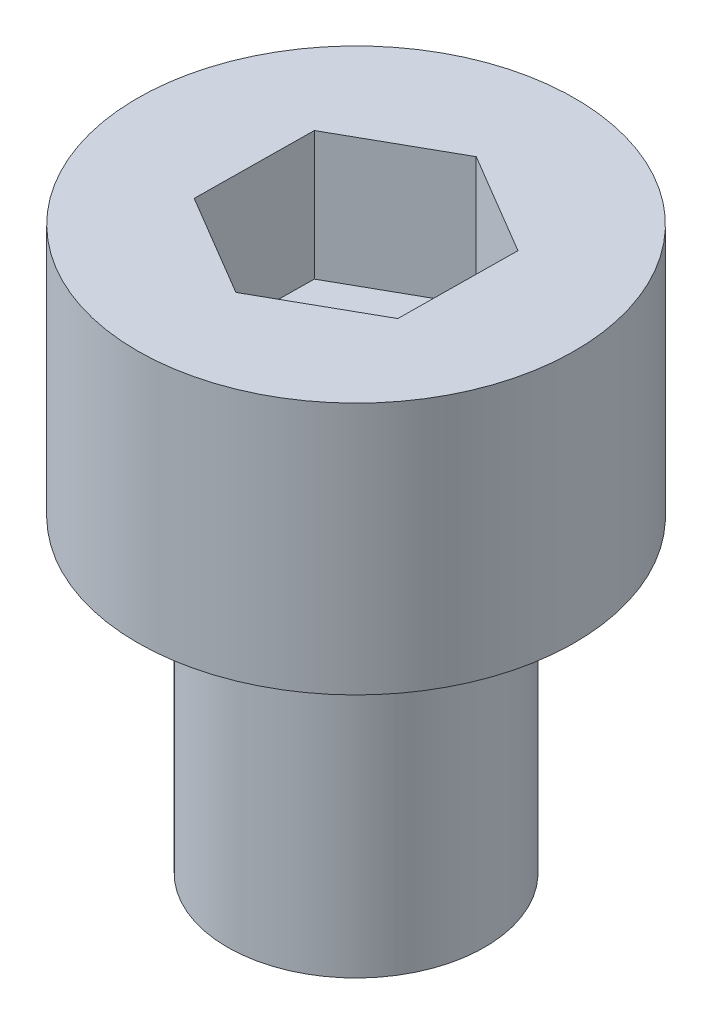
ISO-10303-21;
HEADER;
FILE_DESCRIPTION(('STEP AP214'),'2;1');
FILE_NAME('part.step','',(''),(''),'','','');
FILE_SCHEMA(('AUTOMOTIVE_DESIGN { 1 0 10303 214 1 1 1 1 }'));
ENDSEC;
DATA;
#1=APPLICATION_CONTEXT('core data for automotive mechanical design processes');
#2=APPLICATION_PROTOCOL_DEFINITION('international standard','automotive_design',2000,#1);
#3=PRODUCT_CONTEXT('',#1,'mechanical');
#4=PRODUCT('Part','Part','',(#3));
#5=PRODUCT_RELATED_PRODUCT_CATEGORY('part','',(#4));
#6=PRODUCT_DEFINITION_FORMATION('','',#4);
#7=PRODUCT_DEFINITION_CONTEXT('part definition',#1,'design');
#8=PRODUCT_DEFINITION('design','',#6,#7);
#9=PRODUCT_DEFINITION_SHAPE('','',#8);
#10=(LENGTH_UNIT() NAMED_UNIT(*) SI_UNIT(.MILLI.,.METRE.));
#11=(NAMED_UNIT(*) PLANE_ANGLE_UNIT() SI_UNIT($,.RADIAN.));
#12=(NAMED_UNIT(*) SI_UNIT($,.STERADIAN.) SOLID_ANGLE_UNIT());
#13=UNCERTAINTY_MEASURE_WITH_UNIT(LENGTH_MEASURE(1.E-05),#10,'distance_accuracy_value','');
#14=(GEOMETRIC_REPRESENTATION_CONTEXT(3) GLOBAL_UNCERTAINTY_ASSIGNED_CONTEXT((#13)) GLOBAL_UNIT_ASSIGNED_CONTEXT((#10,
#11,#12)) REPRESENTATION_CONTEXT('',''));
#15=CARTESIAN_POINT('',(0.,0.,0.));
#16=DIRECTION('',(0.,0.,1.));
#17=DIRECTION('',(1.,0.,0.));
#18=AXIS2_PLACEMENT_3D('',#15,#16,#17);
#19=CARTESIAN_POINT('',(0.,6.,0.));
#20=DIRECTION('',(0.,-1.,0.));
#21=DIRECTION('',(0.,0.,-1.));
#22=AXIS2_PLACEMENT_3D('',#19,#20,#21);
#23=CYLINDRICAL_SURFACE('',#22,2.5);
#24=CARTESIAN_POINT('',(0.,6.,0.));
#25=DIRECTION('',(0.,1.,0.));
#26=DIRECTION('',(0.,0.,1.));
#27=AXIS2_PLACEMENT_3D('',#24,#25,#26);
#28=CIRCLE('',#27,2.5);
#29=CARTESIAN_POINT('',(0.,6.,2.5));
#30=VERTEX_POINT('',#29);
#31=EDGE_CURVE('E11',#30,#30,#28,.T.);
#32=ORIENTED_EDGE('',*,*,#31,.F.);
#33=EDGE_LOOP('',(#32));
#34=FACE_BOUND('',#33,.T.);
#35=CARTESIAN_POINT('',(0.,0.,0.));
#36=DIRECTION('',(0.,1.,0.));
#37=DIRECTION('',(0.,0.,1.));
#38=AXIS2_PLACEMENT_3D('',#35,#36,#37);
#39=CIRCLE('',#38,2.5);
#40=CARTESIAN_POINT('',(0.,0.,2.5));
#41=VERTEX_POINT('',#40);
#42=EDGE_CURVE('E36',#41,#41,#39,.T.);
#43=ORIENTED_EDGE('',*,*,#42,.T.);
#44=EDGE_LOOP('',(#43));
#45=FACE_BOUND('',#44,.T.);
#46=ADVANCED_FACE('F33',(#34,#45),#23,.T.);
#47=CARTESIAN_POINT('',(0.,0.,0.));
#48=DIRECTION('',(0.,1.,0.));
#49=DIRECTION('',(0.,0.,1.));
#50=AXIS2_PLACEMENT_3D('',#47,#48,#49);
#51=PLANE('',#50);
#52=ORIENTED_EDGE('',*,*,#42,.F.);
#53=EDGE_LOOP('',(#52));
#54=FACE_BOUND('',#53,.T.);
#55=ADVANCED_FACE('F164',(#54),#51,.F.);
#56=CARTESIAN_POINT('',(0.,10.91,0.));
#57=DIRECTION('',(0.,-1.,0.));
#58=DIRECTION('',(0.,0.,-1.));
#59=AXIS2_PLACEMENT_3D('',#56,#57,#58);
#60=CYLINDRICAL_SURFACE('',#59,4.25);
#61=CARTESIAN_POINT('',(0.,10.91,0.));
#62=DIRECTION('',(0.,1.,0.));
#63=DIRECTION('',(0.,0.,1.));
#64=AXIS2_PLACEMENT_3D('',#61,#62,#63);
#65=CIRCLE('',#64,4.25);
#66=CARTESIAN_POINT('',(0.,10.91,4.25));
#67=VERTEX_POINT('',#66);
#68=EDGE_CURVE('E140',#67,#67,#65,.T.);
#69=ORIENTED_EDGE('',*,*,#68,.F.);
#70=EDGE_LOOP('',(#69));
#71=FACE_BOUND('',#70,.T.);
#72=CARTESIAN_POINT('',(0.,6.,0.));
#73=DIRECTION('',(0.,1.,0.));
#74=DIRECTION('',(0.,0.,1.));
#75=AXIS2_PLACEMENT_3D('',#72,#73,#74);
#76=CIRCLE('',#75,4.25);
#77=CARTESIAN_POINT('',(0.,6.,4.25));
#78=VERTEX_POINT('',#77);
#79=EDGE_CURVE('E134',#78,#78,#76,.T.);
#80=ORIENTED_EDGE('',*,*,#79,.T.);
#81=EDGE_LOOP('',(#80));
#82=FACE_BOUND('',#81,.T.);
#83=ADVANCED_FACE('F146',(#71,#82),#60,.T.);
#84=CARTESIAN_POINT('',(0.,10.91,0.));
#85=DIRECTION('',(0.,1.,0.));
#86=DIRECTION('',(0.,0.,1.));
#87=AXIS2_PLACEMENT_3D('',#84,#85,#86);
#88=PLANE('',#87);
#89=DIRECTION('',(0.871446941935933,0.,-0.490489783166286));
#90=VECTOR('',#89,1.);
#91=CARTESIAN_POINT('',(-0.0252806866898007,10.91,2.3092627005635));
#92=LINE('',#91,#90);
#93=CARTESIAN_POINT('',(-0.0252806866898007,10.91,2.3092627005635));
#94=VERTEX_POINT('',#93);
#95=CARTESIAN_POINT('',(1.98723981935495,10.91,1.17652506718023));
#96=VERTEX_POINT('',#95);
#97=EDGE_CURVE('E47',#94,#96,#92,.T.);
#98=ORIENTED_EDGE('',*,*,#97,.F.);
#99=DIRECTION('',(0.860500083486691,0.,0.509450298183638));
#100=VECTOR('',#99,1.);
#101=CARTESIAN_POINT('',(-2.01252050604475,10.91,1.13273763338327));
#102=LINE('',#101,#100);
#103=CARTESIAN_POINT('',(-2.01252050604475,10.91,1.13273763338327));
#104=VERTEX_POINT('',#103);
#105=EDGE_CURVE('E130',#104,#94,#102,.T.);
#106=ORIENTED_EDGE('',*,*,#105,.F.);
#107=DIRECTION('',(-0.0109468584492415,0.,0.999940081349924));
#108=VECTOR('',#107,1.);
#109=CARTESIAN_POINT('',(-1.98723981935495,10.91,-1.17652506718023));
#110=LINE('',#109,#108);
#111=CARTESIAN_POINT('',(-1.98723981935495,10.91,-1.17652506718023));
#112=VERTEX_POINT('',#111);
#113=EDGE_CURVE('E128',#112,#104,#110,.T.);
#114=ORIENTED_EDGE('',*,*,#113,.F.);
#115=DIRECTION('',(-0.871446941935933,0.,0.490489783166286));
#116=VECTOR('',#115,1.);
#117=CARTESIAN_POINT('',(0.0252806866898017,10.91,-2.3092627005635));
#118=LINE('',#117,#116);
#119=CARTESIAN_POINT('',(0.0252806866898017,10.91,-2.3092627005635));
#120=VERTEX_POINT('',#119);
#121=EDGE_CURVE('E95',#120,#112,#118,.T.);
#122=ORIENTED_EDGE('',*,*,#121,.F.);
#123=DIRECTION('',(-0.860500083486691,0.,-0.509450298183638));
#124=VECTOR('',#123,1.);
#125=CARTESIAN_POINT('',(2.01252050604475,10.91,-1.13273763338327));
#126=LINE('',#125,#124);
#127=CARTESIAN_POINT('',(2.01252050604475,10.91,-1.13273763338327));
#128=VERTEX_POINT('',#127);
#129=EDGE_CURVE('E124',#128,#120,#126,.T.);
#130=ORIENTED_EDGE('',*,*,#129,.F.);
#131=DIRECTION('',(0.0109468584492411,0.,-0.999940081349924));
#132=VECTOR('',#131,1.);
#133=CARTESIAN_POINT('',(1.98723981935495,10.91,1.17652506718023));
#134=LINE('',#133,#132);
#135=EDGE_CURVE('E121',#96,#128,#134,.T.);
#136=ORIENTED_EDGE('',*,*,#135,.F.);
#137=EDGE_LOOP('',(#98,#106,#114,#122,#130,#136));
#138=FACE_BOUND('',#137,.T.);
#139=ORIENTED_EDGE('',*,*,#68,.T.);
#140=EDGE_LOOP('',(#139));
#141=FACE_BOUND('',#140,.T.);
#142=ADVANCED_FACE('F151',(#138,#141),#88,.T.);
#143=CARTESIAN_POINT('',(0.,6.,0.));
#144=DIRECTION('',(0.,1.,0.));
#145=DIRECTION('',(0.,0.,1.));
#146=AXIS2_PLACEMENT_3D('',#143,#144,#145);
#147=PLANE('',#146);
#148=ORIENTED_EDGE('',*,*,#31,.T.);
#149=EDGE_LOOP('',(#148));
#150=FACE_BOUND('',#149,.T.);
#151=ORIENTED_EDGE('',*,*,#79,.F.);
#152=EDGE_LOOP('',(#151));
#153=FACE_BOUND('',#152,.T.);
#154=ADVANCED_FACE('F148',(#150,#153),#147,.F.);
#155=CARTESIAN_POINT('',(-0.0252806866898007,8.41,2.3092627005635));
#156=DIRECTION('',(0.490489783166286,0.,0.871446941935933));
#157=DIRECTION('',(0.871446941935933,0.,-0.490489783166286));
#158=AXIS2_PLACEMENT_3D('',#155,#156,#157);
#159=PLANE('',#158);
#160=ORIENTED_EDGE('',*,*,#97,.T.);
#161=DIRECTION('',(0.,1.,0.));
#162=VECTOR('',#161,1.);
#163=CARTESIAN_POINT('',(1.98723981935495,8.41,1.17652506718023));
#164=LINE('',#163,#162);
#165=CARTESIAN_POINT('',(1.98723981935495,8.41,1.17652506718023));
#166=VERTEX_POINT('',#165);
#167=EDGE_CURVE('E77',#166,#96,#164,.T.);
#168=ORIENTED_EDGE('',*,*,#167,.F.);
#169=DIRECTION('',(0.871446941935933,0.,-0.490489783166286));
#170=VECTOR('',#169,1.);
#171=CARTESIAN_POINT('',(-0.0252806866898007,8.41,2.3092627005635));
#172=LINE('',#171,#170);
#173=CARTESIAN_POINT('',(-0.0252806866898007,8.41,2.3092627005635));
#174=VERTEX_POINT('',#173);
#175=EDGE_CURVE('E132',#174,#166,#172,.T.);
#176=ORIENTED_EDGE('',*,*,#175,.F.);
#177=DIRECTION('',(0.,1.,0.));
#178=VECTOR('',#177,1.);
#179=CARTESIAN_POINT('',(-0.0252806866898007,8.41,2.3092627005635));
#180=LINE('',#179,#178);
#181=EDGE_CURVE('E55',#174,#94,#180,.T.);
#182=ORIENTED_EDGE('',*,*,#181,.T.);
#183=EDGE_LOOP('',(#160,#168,#176,#182));
#184=FACE_BOUND('',#183,.T.);
#185=ADVANCED_FACE('F150',(#184),#159,.F.);
#186=CARTESIAN_POINT('',(-2.01252050604475,8.41,1.13273763338327));
#187=DIRECTION('',(-0.509450298183638,0.,0.860500083486691));
#188=DIRECTION('',(0.860500083486691,0.,0.509450298183638));
#189=AXIS2_PLACEMENT_3D('',#186,#187,#188);
#190=PLANE('',#189);
#191=ORIENTED_EDGE('',*,*,#105,.T.);
#192=ORIENTED_EDGE('',*,*,#181,.F.);
#193=DIRECTION('',(0.860500083486691,0.,0.509450298183638));
#194=VECTOR('',#193,1.);
#195=CARTESIAN_POINT('',(-2.01252050604475,8.41,1.13273763338327));
#196=LINE('',#195,#194);
#197=CARTESIAN_POINT('',(-2.01252050604475,8.41,1.13273763338327));
#198=VERTEX_POINT('',#197);
#199=EDGE_CURVE('E107',#198,#174,#196,.T.);
#200=ORIENTED_EDGE('',*,*,#199,.F.);
#201=DIRECTION('',(0.,1.,0.));
#202=VECTOR('',#201,1.);
#203=CARTESIAN_POINT('',(-2.01252050604475,8.41,1.13273763338327));
#204=LINE('',#203,#202);
#205=EDGE_CURVE('E99',#198,#104,#204,.T.);
#206=ORIENTED_EDGE('',*,*,#205,.T.);
#207=EDGE_LOOP('',(#191,#192,#200,#206));
#208=FACE_BOUND('',#207,.T.);
#209=ADVANCED_FACE('F158',(#208),#190,.F.);
#210=CARTESIAN_POINT('',(-1.98723981935495,8.41,-1.17652506718023));
#211=DIRECTION('',(-0.999940081349924,0.,-0.0109468584492415));
#212=DIRECTION('',(-0.0109468584492415,0.,0.999940081349924));
#213=AXIS2_PLACEMENT_3D('',#210,#211,#212);
#214=PLANE('',#213);
#215=ORIENTED_EDGE('',*,*,#113,.T.);
#216=ORIENTED_EDGE('',*,*,#205,.F.);
#217=DIRECTION('',(-0.0109468584492415,0.,0.999940081349924));
#218=VECTOR('',#217,1.);
#219=CARTESIAN_POINT('',(-1.98723981935495,8.41,-1.17652506718023));
#220=LINE('',#219,#218);
#221=CARTESIAN_POINT('',(-1.98723981935495,8.41,-1.17652506718023));
#222=VERTEX_POINT('',#221);
#223=EDGE_CURVE('E103',#222,#198,#220,.T.);
#224=ORIENTED_EDGE('',*,*,#223,.F.);
#225=DIRECTION('',(0.,1.,0.));
#226=VECTOR('',#225,1.);
#227=CARTESIAN_POINT('',(-1.98723981935495,8.41,-1.17652506718023));
#228=LINE('',#227,#226);
#229=EDGE_CURVE('E88',#222,#112,#228,.T.);
#230=ORIENTED_EDGE('',*,*,#229,.T.);
#231=EDGE_LOOP('',(#215,#216,#224,#230));
#232=FACE_BOUND('',#231,.T.);
#233=ADVANCED_FACE('F104',(#232),#214,.F.);
#234=CARTESIAN_POINT('',(0.0252806866898017,8.41,-2.3092627005635));
#235=DIRECTION('',(-0.490489783166286,0.,-0.871446941935933));
#236=DIRECTION('',(-0.871446941935933,0.,0.490489783166286));
#237=AXIS2_PLACEMENT_3D('',#234,#235,#236);
#238=PLANE('',#237);
#239=ORIENTED_EDGE('',*,*,#121,.T.);
#240=ORIENTED_EDGE('',*,*,#229,.F.);
#241=DIRECTION('',(-0.871446941935933,0.,0.490489783166286));
#242=VECTOR('',#241,1.);
#243=CARTESIAN_POINT('',(0.0252806866898017,8.41,-2.3092627005635));
#244=LINE('',#243,#242);
#245=CARTESIAN_POINT('',(0.0252806866898017,8.41,-2.3092627005635));
#246=VERTEX_POINT('',#245);
#247=EDGE_CURVE('E92',#246,#222,#244,.T.);
#248=ORIENTED_EDGE('',*,*,#247,.F.);
#249=DIRECTION('',(0.,1.,0.));
#250=VECTOR('',#249,1.);
#251=CARTESIAN_POINT('',(0.0252806866898017,8.41,-2.3092627005635));
#252=LINE('',#251,#250);
#253=EDGE_CURVE('E100',#246,#120,#252,.T.);
#254=ORIENTED_EDGE('',*,*,#253,.T.);
#255=EDGE_LOOP('',(#239,#240,#248,#254));
#256=FACE_BOUND('',#255,.T.);
#257=ADVANCED_FACE('F90',(#256),#238,.F.);
#258=CARTESIAN_POINT('',(2.01252050604475,8.41,-1.13273763338327));
#259=DIRECTION('',(0.509450298183638,0.,-0.860500083486691));
#260=DIRECTION('',(-0.860500083486691,0.,-0.509450298183638));
#261=AXIS2_PLACEMENT_3D('',#258,#259,#260);
#262=PLANE('',#261);
#263=ORIENTED_EDGE('',*,*,#129,.T.);
#264=ORIENTED_EDGE('',*,*,#253,.F.);
#265=DIRECTION('',(-0.860500083486691,0.,-0.509450298183638));
#266=VECTOR('',#265,1.);
#267=CARTESIAN_POINT('',(2.01252050604475,8.41,-1.13273763338327));
#268=LINE('',#267,#266);
#269=CARTESIAN_POINT('',(2.01252050604475,8.41,-1.13273763338327));
#270=VERTEX_POINT('',#269);
#271=EDGE_CURVE('E113',#270,#246,#268,.T.);
#272=ORIENTED_EDGE('',*,*,#271,.F.);
#273=DIRECTION('',(0.,1.,0.));
#274=VECTOR('',#273,1.);
#275=CARTESIAN_POINT('',(2.01252050604475,8.41,-1.13273763338327));
#276=LINE('',#275,#274);
#277=EDGE_CURVE('E137',#270,#128,#276,.T.);
#278=ORIENTED_EDGE('',*,*,#277,.T.);
#279=EDGE_LOOP('',(#263,#264,#272,#278));
#280=FACE_BOUND('',#279,.T.);
#281=ADVANCED_FACE('F219',(#280),#262,.F.);
#282=CARTESIAN_POINT('',(1.98723981935495,8.41,1.17652506718023));
#283=DIRECTION('',(0.999940081349924,0.,0.0109468584492411));
#284=DIRECTION('',(0.0109468584492411,0.,-0.999940081349924));
#285=AXIS2_PLACEMENT_3D('',#282,#283,#284);
#286=PLANE('',#285);
#287=ORIENTED_EDGE('',*,*,#135,.T.);
#288=ORIENTED_EDGE('',*,*,#277,.F.);
#289=DIRECTION('',(0.0109468584492411,0.,-0.999940081349924));
#290=VECTOR('',#289,1.);
#291=CARTESIAN_POINT('',(1.98723981935495,8.41,1.17652506718023));
#292=LINE('',#291,#290);
#293=EDGE_CURVE('E115',#166,#270,#292,.T.);
#294=ORIENTED_EDGE('',*,*,#293,.F.);
#295=ORIENTED_EDGE('',*,*,#167,.T.);
#296=EDGE_LOOP('',(#287,#288,#294,#295));
#297=FACE_BOUND('',#296,.T.);
#298=ADVANCED_FACE('F228',(#297),#286,.F.);
#299=CARTESIAN_POINT('',(0.,8.41,0.));
#300=DIRECTION('',(0.,1.,0.));
#301=DIRECTION('',(0.,0.,1.));
#302=AXIS2_PLACEMENT_3D('',#299,#300,#301);
#303=PLANE('',#302);
#304=ORIENTED_EDGE('',*,*,#175,.T.);
#305=ORIENTED_EDGE('',*,*,#293,.T.);
#306=ORIENTED_EDGE('',*,*,#271,.T.);
#307=ORIENTED_EDGE('',*,*,#247,.T.);
#308=ORIENTED_EDGE('',*,*,#223,.T.);
#309=ORIENTED_EDGE('',*,*,#199,.T.);
#310=EDGE_LOOP('',(#304,#305,#306,#307,#308,#309));
#311=FACE_BOUND('',#310,.T.);
#312=ADVANCED_FACE('F110',(#311),#303,.T.);
#313=CLOSED_SHELL('',(#46,#55,#83,#142,#154,#185,#209,#233,#257,#281,#298,#312));
#314=MANIFOLD_SOLID_BREP('B2',#313);
#315=ADVANCED_BREP_SHAPE_REPRESENTATION('',(#18,#314),#14);
#316=SHAPE_DEFINITION_REPRESENTATION(#9,#315);
ENDSEC;
END-ISO-10303-21;
